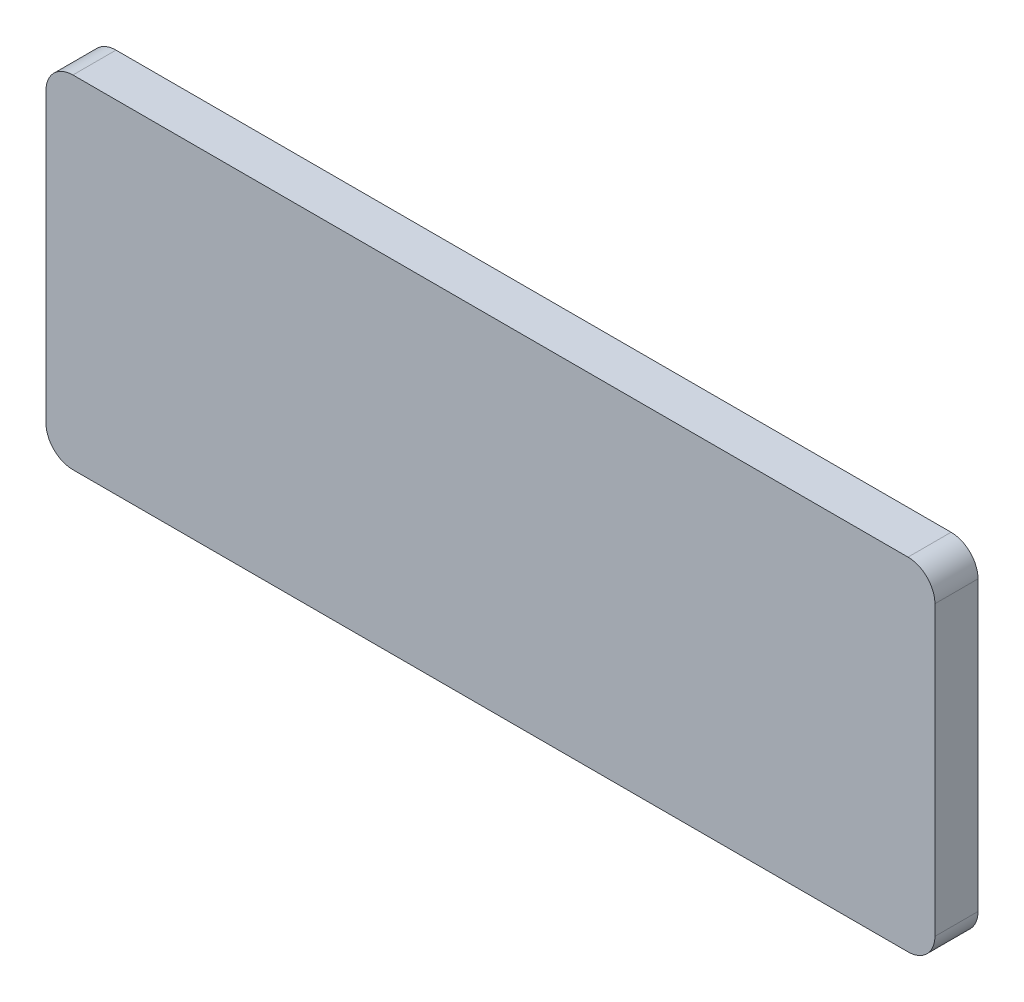
ISO-10303-21;
HEADER;
FILE_DESCRIPTION(('STEP AP214'),'2;1');
FILE_NAME('part.step','',(''),(''),'','','');
FILE_SCHEMA(('AUTOMOTIVE_DESIGN { 1 0 10303 214 1 1 1 1 }'));
ENDSEC;
DATA;
#1=APPLICATION_CONTEXT('core data for automotive mechanical design processes');
#2=APPLICATION_PROTOCOL_DEFINITION('international standard','automotive_design',2000,#1);
#3=PRODUCT_CONTEXT('',#1,'mechanical');
#4=PRODUCT('Part','Part','',(#3));
#5=PRODUCT_RELATED_PRODUCT_CATEGORY('part','',(#4));
#6=PRODUCT_DEFINITION_FORMATION('','',#4);
#7=PRODUCT_DEFINITION_CONTEXT('part definition',#1,'design');
#8=PRODUCT_DEFINITION('design','',#6,#7);
#9=PRODUCT_DEFINITION_SHAPE('','',#8);
#10=(LENGTH_UNIT() NAMED_UNIT(*) SI_UNIT(.MILLI.,.METRE.));
#11=(NAMED_UNIT(*) PLANE_ANGLE_UNIT() SI_UNIT($,.RADIAN.));
#12=(NAMED_UNIT(*) SI_UNIT($,.STERADIAN.) SOLID_ANGLE_UNIT());
#13=UNCERTAINTY_MEASURE_WITH_UNIT(LENGTH_MEASURE(1.E-05),#10,'distance_accuracy_value','');
#14=(GEOMETRIC_REPRESENTATION_CONTEXT(3) GLOBAL_UNCERTAINTY_ASSIGNED_CONTEXT((#13)) GLOBAL_UNIT_ASSIGNED_CONTEXT((#10,
#11,#12)) REPRESENTATION_CONTEXT('',''));
#15=CARTESIAN_POINT('',(0.,0.,0.));
#16=DIRECTION('',(0.,0.,1.));
#17=DIRECTION('',(1.,0.,0.));
#18=AXIS2_PLACEMENT_3D('',#15,#16,#17);
#19=CARTESIAN_POINT('',(-16.51,-6.35,1.6));
#20=DIRECTION('',(1.,0.,0.));
#21=DIRECTION('',(0.,0.,-1.));
#22=AXIS2_PLACEMENT_3D('',#19,#20,#21);
#23=PLANE('',#22);
#24=DIRECTION('',(0.,-1.,0.));
#25=VECTOR('',#24,1.);
#26=CARTESIAN_POINT('',(-16.51,-6.35,0.));
#27=LINE('',#26,#25);
#28=CARTESIAN_POINT('',(-16.51,5.35,0.));
#29=VERTEX_POINT('',#28);
#30=CARTESIAN_POINT('',(-16.51,-5.35,0.));
#31=VERTEX_POINT('',#30);
#32=EDGE_CURVE('E140',#29,#31,#27,.T.);
#33=ORIENTED_EDGE('',*,*,#32,.T.);
#34=DIRECTION('',(0.,0.,-1.));
#35=VECTOR('',#34,1.);
#36=CARTESIAN_POINT('',(-16.51,-5.35,1.6));
#37=LINE('',#36,#35);
#38=CARTESIAN_POINT('',(-16.51,-5.35,1.6));
#39=VERTEX_POINT('',#38);
#40=EDGE_CURVE('E115',#31,#39,#37,.F.);
#41=ORIENTED_EDGE('',*,*,#40,.T.);
#42=DIRECTION('',(0.,-1.,0.));
#43=VECTOR('',#42,1.);
#44=CARTESIAN_POINT('',(-16.51,-6.35,1.6));
#45=LINE('',#44,#43);
#46=CARTESIAN_POINT('',(-16.51,5.35,1.6));
#47=VERTEX_POINT('',#46);
#48=EDGE_CURVE('E152',#47,#39,#45,.T.);
#49=ORIENTED_EDGE('',*,*,#48,.F.);
#50=DIRECTION('',(0.,0.,-1.));
#51=VECTOR('',#50,1.);
#52=CARTESIAN_POINT('',(-16.51,5.35,1.6));
#53=LINE('',#52,#51);
#54=EDGE_CURVE('E121',#47,#29,#53,.T.);
#55=ORIENTED_EDGE('',*,*,#54,.T.);
#56=EDGE_LOOP('',(#33,#41,#49,#55));
#57=FACE_BOUND('',#56,.T.);
#58=ADVANCED_FACE('F43',(#57),#23,.F.);
#59=CARTESIAN_POINT('',(16.51,-6.35,1.6));
#60=DIRECTION('',(0.,1.,0.));
#61=DIRECTION('',(-1.,0.,0.));
#62=AXIS2_PLACEMENT_3D('',#59,#60,#61);
#63=PLANE('',#62);
#64=DIRECTION('',(1.,0.,0.));
#65=VECTOR('',#64,1.);
#66=CARTESIAN_POINT('',(16.51,-6.35,1.6));
#67=LINE('',#66,#65);
#68=CARTESIAN_POINT('',(-15.51,-6.35,1.6));
#69=VERTEX_POINT('',#68);
#70=CARTESIAN_POINT('',(15.51,-6.35,1.6));
#71=VERTEX_POINT('',#70);
#72=EDGE_CURVE('E131',#69,#71,#67,.T.);
#73=ORIENTED_EDGE('',*,*,#72,.F.);
#74=DIRECTION('',(0.,0.,-1.));
#75=VECTOR('',#74,1.);
#76=CARTESIAN_POINT('',(-15.51,-6.35,1.6));
#77=LINE('',#76,#75);
#78=CARTESIAN_POINT('',(-15.51,-6.35,0.));
#79=VERTEX_POINT('',#78);
#80=EDGE_CURVE('E114',#69,#79,#77,.T.);
#81=ORIENTED_EDGE('',*,*,#80,.T.);
#82=DIRECTION('',(1.,0.,0.));
#83=VECTOR('',#82,1.);
#84=CARTESIAN_POINT('',(16.51,-6.35,0.));
#85=LINE('',#84,#83);
#86=CARTESIAN_POINT('',(15.51,-6.35,0.));
#87=VERTEX_POINT('',#86);
#88=EDGE_CURVE('E128',#79,#87,#85,.T.);
#89=ORIENTED_EDGE('',*,*,#88,.T.);
#90=DIRECTION('',(0.,0.,-1.));
#91=VECTOR('',#90,1.);
#92=CARTESIAN_POINT('',(15.51,-6.35,1.6));
#93=LINE('',#92,#91);
#94=EDGE_CURVE('E134',#87,#71,#93,.F.);
#95=ORIENTED_EDGE('',*,*,#94,.T.);
#96=EDGE_LOOP('',(#73,#81,#89,#95));
#97=FACE_BOUND('',#96,.T.);
#98=ADVANCED_FACE('F127',(#97),#63,.F.);
#99=CARTESIAN_POINT('',(16.51,-6.35,1.6));
#100=DIRECTION('',(-1.,0.,0.));
#101=DIRECTION('',(0.,0.,1.));
#102=AXIS2_PLACEMENT_3D('',#99,#100,#101);
#103=PLANE('',#102);
#104=DIRECTION('',(0.,1.,0.));
#105=VECTOR('',#104,1.);
#106=CARTESIAN_POINT('',(16.51,-6.35,1.6));
#107=LINE('',#106,#105);
#108=CARTESIAN_POINT('',(16.51,-5.35,1.6));
#109=VERTEX_POINT('',#108);
#110=CARTESIAN_POINT('',(16.51,5.35,1.6));
#111=VERTEX_POINT('',#110);
#112=EDGE_CURVE('E188',#109,#111,#107,.T.);
#113=ORIENTED_EDGE('',*,*,#112,.F.);
#114=DIRECTION('',(0.,0.,-1.));
#115=VECTOR('',#114,1.);
#116=CARTESIAN_POINT('',(16.51,-5.35,1.6));
#117=LINE('',#116,#115);
#118=CARTESIAN_POINT('',(16.51,-5.35,0.));
#119=VERTEX_POINT('',#118);
#120=EDGE_CURVE('E182',#109,#119,#117,.T.);
#121=ORIENTED_EDGE('',*,*,#120,.T.);
#122=DIRECTION('',(0.,1.,0.));
#123=VECTOR('',#122,1.);
#124=CARTESIAN_POINT('',(16.51,-6.35,0.));
#125=LINE('',#124,#123);
#126=CARTESIAN_POINT('',(16.51,5.35,0.));
#127=VERTEX_POINT('',#126);
#128=EDGE_CURVE('E139',#119,#127,#125,.T.);
#129=ORIENTED_EDGE('',*,*,#128,.T.);
#130=DIRECTION('',(0.,0.,-1.));
#131=VECTOR('',#130,1.);
#132=CARTESIAN_POINT('',(16.51,5.35,1.6));
#133=LINE('',#132,#131);
#134=EDGE_CURVE('E179',#127,#111,#133,.F.);
#135=ORIENTED_EDGE('',*,*,#134,.T.);
#136=EDGE_LOOP('',(#113,#121,#129,#135));
#137=FACE_BOUND('',#136,.T.);
#138=ADVANCED_FACE('F209',(#137),#103,.F.);
#139=CARTESIAN_POINT('',(16.51,6.35,1.6));
#140=DIRECTION('',(0.,-1.,0.));
#141=DIRECTION('',(1.,0.,0.));
#142=AXIS2_PLACEMENT_3D('',#139,#140,#141);
#143=PLANE('',#142);
#144=DIRECTION('',(-1.,0.,0.));
#145=VECTOR('',#144,1.);
#146=CARTESIAN_POINT('',(16.51,6.35,1.6));
#147=LINE('',#146,#145);
#148=CARTESIAN_POINT('',(15.51,6.35,1.6));
#149=VERTEX_POINT('',#148);
#150=CARTESIAN_POINT('',(-15.51,6.35,1.6));
#151=VERTEX_POINT('',#150);
#152=EDGE_CURVE('E154',#149,#151,#147,.T.);
#153=ORIENTED_EDGE('',*,*,#152,.F.);
#154=DIRECTION('',(0.,0.,-1.));
#155=VECTOR('',#154,1.);
#156=CARTESIAN_POINT('',(15.51,6.35,1.6));
#157=LINE('',#156,#155);
#158=CARTESIAN_POINT('',(15.51,6.35,0.));
#159=VERTEX_POINT('',#158);
#160=EDGE_CURVE('E11',#149,#159,#157,.T.);
#161=ORIENTED_EDGE('',*,*,#160,.T.);
#162=DIRECTION('',(-1.,0.,0.));
#163=VECTOR('',#162,1.);
#164=CARTESIAN_POINT('',(16.51,6.35,0.));
#165=LINE('',#164,#163);
#166=CARTESIAN_POINT('',(-15.51,6.35,0.));
#167=VERTEX_POINT('',#166);
#168=EDGE_CURVE('E145',#159,#167,#165,.T.);
#169=ORIENTED_EDGE('',*,*,#168,.T.);
#170=DIRECTION('',(0.,0.,-1.));
#171=VECTOR('',#170,1.);
#172=CARTESIAN_POINT('',(-15.51,6.35,1.6));
#173=LINE('',#172,#171);
#174=EDGE_CURVE('E52',#167,#151,#173,.F.);
#175=ORIENTED_EDGE('',*,*,#174,.T.);
#176=EDGE_LOOP('',(#153,#161,#169,#175));
#177=FACE_BOUND('',#176,.T.);
#178=ADVANCED_FACE('F202',(#177),#143,.F.);
#179=CARTESIAN_POINT('',(0.,0.,1.6));
#180=DIRECTION('',(0.,0.,1.));
#181=DIRECTION('',(1.,0.,0.));
#182=AXIS2_PLACEMENT_3D('',#179,#180,#181);
#183=PLANE('',#182);
#184=ORIENTED_EDGE('',*,*,#48,.T.);
#185=CARTESIAN_POINT('',(-15.51,-5.35,1.6));
#186=DIRECTION('',(0.,0.,1.));
#187=DIRECTION('',(1.,0.,0.));
#188=AXIS2_PLACEMENT_3D('',#185,#186,#187);
#189=CIRCLE('',#188,1.);
#190=EDGE_CURVE('E176',#39,#69,#189,.T.);
#191=ORIENTED_EDGE('',*,*,#190,.T.);
#192=ORIENTED_EDGE('',*,*,#72,.T.);
#193=CARTESIAN_POINT('',(15.51,-5.35,1.6));
#194=DIRECTION('',(0.,0.,1.));
#195=DIRECTION('',(1.,0.,0.));
#196=AXIS2_PLACEMENT_3D('',#193,#194,#195);
#197=CIRCLE('',#196,1.);
#198=EDGE_CURVE('E173',#71,#109,#197,.T.);
#199=ORIENTED_EDGE('',*,*,#198,.T.);
#200=ORIENTED_EDGE('',*,*,#112,.T.);
#201=CARTESIAN_POINT('',(15.51,5.35,1.6));
#202=DIRECTION('',(0.,0.,1.));
#203=DIRECTION('',(1.,0.,0.));
#204=AXIS2_PLACEMENT_3D('',#201,#202,#203);
#205=CIRCLE('',#204,1.);
#206=EDGE_CURVE('E65',#111,#149,#205,.T.);
#207=ORIENTED_EDGE('',*,*,#206,.T.);
#208=ORIENTED_EDGE('',*,*,#152,.T.);
#209=CARTESIAN_POINT('',(-15.51,5.35,1.6));
#210=DIRECTION('',(0.,0.,1.));
#211=DIRECTION('',(1.,0.,0.));
#212=AXIS2_PLACEMENT_3D('',#209,#210,#211);
#213=CIRCLE('',#212,1.);
#214=EDGE_CURVE('E168',#151,#47,#213,.T.);
#215=ORIENTED_EDGE('',*,*,#214,.T.);
#216=EDGE_LOOP('',(#184,#191,#192,#199,#200,#207,#208,#215));
#217=FACE_BOUND('',#216,.T.);
#218=ADVANCED_FACE('F196',(#217),#183,.T.);
#219=CARTESIAN_POINT('',(0.,0.,0.));
#220=DIRECTION('',(0.,0.,1.));
#221=DIRECTION('',(1.,0.,0.));
#222=AXIS2_PLACEMENT_3D('',#219,#220,#221);
#223=PLANE('',#222);
#224=ORIENTED_EDGE('',*,*,#88,.F.);
#225=CARTESIAN_POINT('',(-15.51,-5.35,0.));
#226=DIRECTION('',(0.,0.,1.));
#227=DIRECTION('',(1.,0.,0.));
#228=AXIS2_PLACEMENT_3D('',#225,#226,#227);
#229=CIRCLE('',#228,1.);
#230=EDGE_CURVE('E110',#79,#31,#229,.F.);
#231=ORIENTED_EDGE('',*,*,#230,.T.);
#232=ORIENTED_EDGE('',*,*,#32,.F.);
#233=CARTESIAN_POINT('',(-15.51,5.35,0.));
#234=DIRECTION('',(0.,0.,1.));
#235=DIRECTION('',(1.,0.,0.));
#236=AXIS2_PLACEMENT_3D('',#233,#234,#235);
#237=CIRCLE('',#236,1.);
#238=EDGE_CURVE('E133',#29,#167,#237,.F.);
#239=ORIENTED_EDGE('',*,*,#238,.T.);
#240=ORIENTED_EDGE('',*,*,#168,.F.);
#241=CARTESIAN_POINT('',(15.51,5.35,0.));
#242=DIRECTION('',(0.,0.,1.));
#243=DIRECTION('',(1.,0.,0.));
#244=AXIS2_PLACEMENT_3D('',#241,#242,#243);
#245=CIRCLE('',#244,1.);
#246=EDGE_CURVE('E158',#159,#127,#245,.F.);
#247=ORIENTED_EDGE('',*,*,#246,.T.);
#248=ORIENTED_EDGE('',*,*,#128,.F.);
#249=CARTESIAN_POINT('',(15.51,-5.35,0.));
#250=DIRECTION('',(0.,0.,1.));
#251=DIRECTION('',(1.,0.,0.));
#252=AXIS2_PLACEMENT_3D('',#249,#250,#251);
#253=CIRCLE('',#252,1.);
#254=EDGE_CURVE('E122',#119,#87,#253,.F.);
#255=ORIENTED_EDGE('',*,*,#254,.T.);
#256=EDGE_LOOP('',(#224,#231,#232,#239,#240,#247,#248,#255));
#257=FACE_BOUND('',#256,.T.);
#258=ADVANCED_FACE('F136',(#257),#223,.F.);
#259=CARTESIAN_POINT('',(-15.51,-5.35,1.6));
#260=DIRECTION('',(0.,0.,-1.));
#261=DIRECTION('',(-1.,0.,0.));
#262=AXIS2_PLACEMENT_3D('',#259,#260,#261);
#263=CYLINDRICAL_SURFACE('',#262,1.);
#264=ORIENTED_EDGE('',*,*,#190,.F.);
#265=ORIENTED_EDGE('',*,*,#40,.F.);
#266=ORIENTED_EDGE('',*,*,#230,.F.);
#267=ORIENTED_EDGE('',*,*,#80,.F.);
#268=EDGE_LOOP('',(#264,#265,#266,#267));
#269=FACE_BOUND('',#268,.T.);
#270=ADVANCED_FACE('F113',(#269),#263,.T.);
#271=CARTESIAN_POINT('',(15.51,-5.35,1.6));
#272=DIRECTION('',(0.,0.,-1.));
#273=DIRECTION('',(-1.,0.,0.));
#274=AXIS2_PLACEMENT_3D('',#271,#272,#273);
#275=CYLINDRICAL_SURFACE('',#274,1.);
#276=ORIENTED_EDGE('',*,*,#198,.F.);
#277=ORIENTED_EDGE('',*,*,#94,.F.);
#278=ORIENTED_EDGE('',*,*,#254,.F.);
#279=ORIENTED_EDGE('',*,*,#120,.F.);
#280=EDGE_LOOP('',(#276,#277,#278,#279));
#281=FACE_BOUND('',#280,.T.);
#282=ADVANCED_FACE('F213',(#281),#275,.T.);
#283=CARTESIAN_POINT('',(15.51,5.35,1.6));
#284=DIRECTION('',(0.,0.,-1.));
#285=DIRECTION('',(-1.,0.,0.));
#286=AXIS2_PLACEMENT_3D('',#283,#284,#285);
#287=CYLINDRICAL_SURFACE('',#286,1.);
#288=ORIENTED_EDGE('',*,*,#206,.F.);
#289=ORIENTED_EDGE('',*,*,#134,.F.);
#290=ORIENTED_EDGE('',*,*,#246,.F.);
#291=ORIENTED_EDGE('',*,*,#160,.F.);
#292=EDGE_LOOP('',(#288,#289,#290,#291));
#293=FACE_BOUND('',#292,.T.);
#294=ADVANCED_FACE('F205',(#293),#287,.T.);
#295=CARTESIAN_POINT('',(-15.51,5.35,1.6));
#296=DIRECTION('',(0.,0.,-1.));
#297=DIRECTION('',(-1.,0.,0.));
#298=AXIS2_PLACEMENT_3D('',#295,#296,#297);
#299=CYLINDRICAL_SURFACE('',#298,1.);
#300=ORIENTED_EDGE('',*,*,#214,.F.);
#301=ORIENTED_EDGE('',*,*,#174,.F.);
#302=ORIENTED_EDGE('',*,*,#238,.F.);
#303=ORIENTED_EDGE('',*,*,#54,.F.);
#304=EDGE_LOOP('',(#300,#301,#302,#303));
#305=FACE_BOUND('',#304,.T.);
#306=ADVANCED_FACE('F45',(#305),#299,.T.);
#307=CLOSED_SHELL('',(#58,#98,#138,#178,#218,#258,#270,#282,#294,#306));
#308=MANIFOLD_SOLID_BREP('B2',#307);
#309=ADVANCED_BREP_SHAPE_REPRESENTATION('',(#18,#308),#14);
#310=SHAPE_DEFINITION_REPRESENTATION(#9,#309);
ENDSEC;
END-ISO-10303-21;
